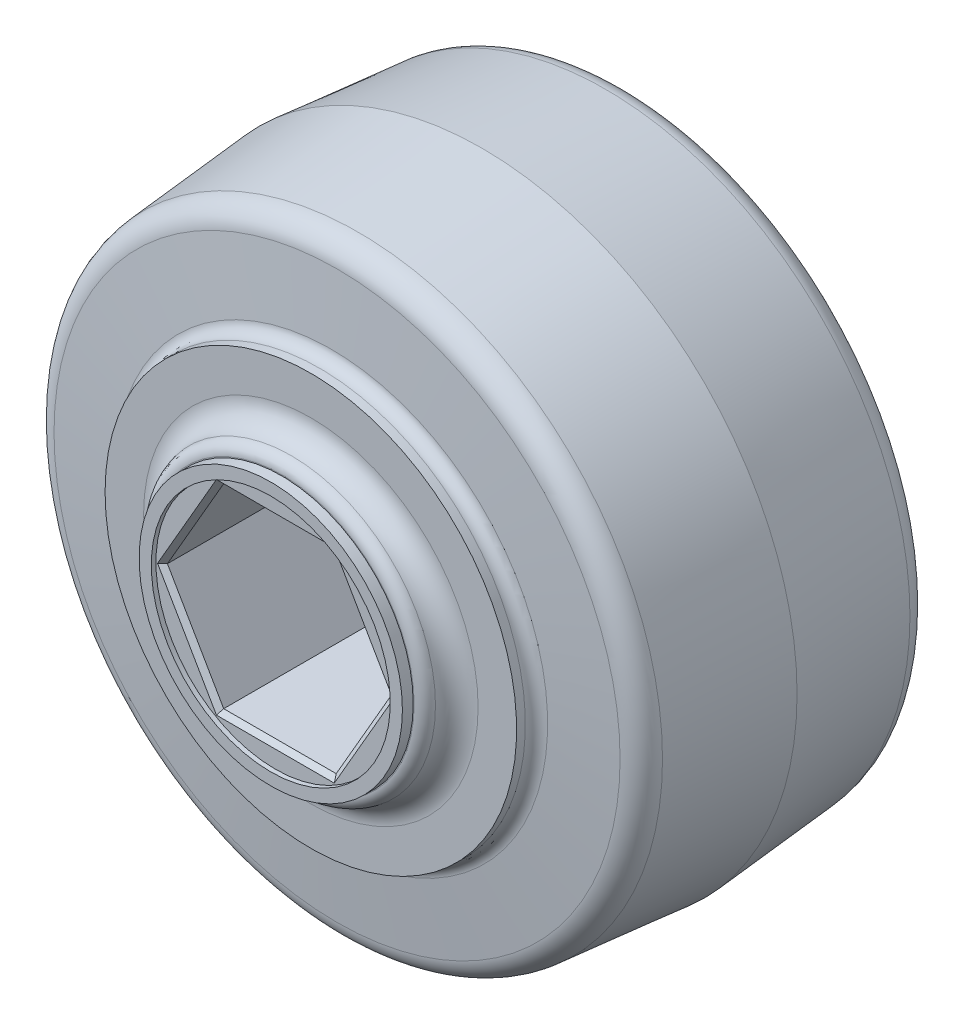
ISO-10303-21;
HEADER;
FILE_DESCRIPTION(('STEP AP214'),'2;1');
FILE_NAME('part.step','',(''),(''),'','','');
FILE_SCHEMA(('AUTOMOTIVE_DESIGN { 1 0 10303 214 1 1 1 1 }'));
ENDSEC;
DATA;
#1=APPLICATION_CONTEXT('core data for automotive mechanical design processes');
#2=APPLICATION_PROTOCOL_DEFINITION('international standard','automotive_design',2000,#1);
#3=PRODUCT_CONTEXT('',#1,'mechanical');
#4=PRODUCT('Part','Part','',(#3));
#5=PRODUCT_RELATED_PRODUCT_CATEGORY('part','',(#4));
#6=PRODUCT_DEFINITION_FORMATION('','',#4);
#7=PRODUCT_DEFINITION_CONTEXT('part definition',#1,'design');
#8=PRODUCT_DEFINITION('design','',#6,#7);
#9=PRODUCT_DEFINITION_SHAPE('','',#8);
#10=(LENGTH_UNIT() NAMED_UNIT(*) SI_UNIT(.MILLI.,.METRE.));
#11=(NAMED_UNIT(*) PLANE_ANGLE_UNIT() SI_UNIT($,.RADIAN.));
#12=(NAMED_UNIT(*) SI_UNIT($,.STERADIAN.) SOLID_ANGLE_UNIT());
#13=UNCERTAINTY_MEASURE_WITH_UNIT(LENGTH_MEASURE(1.E-05),#10,'distance_accuracy_value','');
#14=(GEOMETRIC_REPRESENTATION_CONTEXT(3) GLOBAL_UNCERTAINTY_ASSIGNED_CONTEXT((#13)) GLOBAL_UNIT_ASSIGNED_CONTEXT((#10,
#11,#12)) REPRESENTATION_CONTEXT('',''));
#15=CARTESIAN_POINT('',(0.,0.,0.));
#16=DIRECTION('',(0.,0.,1.));
#17=DIRECTION('',(1.,0.,0.));
#18=AXIS2_PLACEMENT_3D('',#15,#16,#17);
#19=CARTESIAN_POINT('',(0.,0.,-13.0937));
#20=DIRECTION('',(0.,0.,-1.));
#21=DIRECTION('',(-1.,0.,0.));
#22=AXIS2_PLACEMENT_3D('',#19,#20,#21);
#23=PLANE('',#22);
#24=CARTESIAN_POINT('',(0.,0.,-13.0937));
#25=DIRECTION('',(0.,0.,-1.));
#26=DIRECTION('',(-1.,0.,0.));
#27=AXIS2_PLACEMENT_3D('',#24,#25,#26);
#28=CIRCLE('',#27,8.66586367654745);
#29=CARTESIAN_POINT('',(-8.66586367654745,0.,-13.0937));
#30=VERTEX_POINT('',#29);
#31=EDGE_CURVE('E208',#30,#30,#28,.T.);
#32=ORIENTED_EDGE('',*,*,#31,.T.);
#33=EDGE_LOOP('',(#32));
#34=FACE_BOUND('',#33,.T.);
#35=CARTESIAN_POINT('',(0.,0.,-13.0937));
#36=DIRECTION('',(0.,0.,-1.));
#37=DIRECTION('',(-1.,0.,0.));
#38=AXIS2_PLACEMENT_3D('',#35,#36,#37);
#39=CIRCLE('',#38,8.60349118345969);
#40=CARTESIAN_POINT('',(-8.60349118345969,0.,-13.0937));
#41=VERTEX_POINT('',#40);
#42=EDGE_CURVE('E420',#41,#41,#39,.T.);
#43=ORIENTED_EDGE('',*,*,#42,.F.);
#44=EDGE_LOOP('',(#43));
#45=FACE_BOUND('',#44,.T.);
#46=ADVANCED_FACE('F34',(#34,#45),#23,.T.);
#47=CARTESIAN_POINT('',(9.44973089756054,0.,13.0937));
#48=DIRECTION('',(0.,0.,1.));
#49=DIRECTION('',(1.,0.,0.));
#50=AXIS2_PLACEMENT_3D('',#47,#48,#49);
#51=PLANE('',#50);
#52=CARTESIAN_POINT('',(0.,0.,13.0937));
#53=DIRECTION('',(0.,0.,1.));
#54=DIRECTION('',(1.,0.,0.));
#55=AXIS2_PLACEMENT_3D('',#52,#53,#54);
#56=CIRCLE('',#55,8.66586367654745);
#57=CARTESIAN_POINT('',(8.66586367654745,0.,13.0937));
#58=VERTEX_POINT('',#57);
#59=EDGE_CURVE('E244',#58,#58,#56,.T.);
#60=ORIENTED_EDGE('',*,*,#59,.T.);
#61=EDGE_LOOP('',(#60));
#62=FACE_BOUND('',#61,.T.);
#63=CARTESIAN_POINT('',(0.,0.,13.0937));
#64=DIRECTION('',(0.,0.,1.));
#65=DIRECTION('',(1.,0.,0.));
#66=AXIS2_PLACEMENT_3D('',#63,#64,#65);
#67=CIRCLE('',#66,8.60349118345969);
#68=CARTESIAN_POINT('',(8.60349118345969,0.,13.0937));
#69=VERTEX_POINT('',#68);
#70=EDGE_CURVE('E414',#69,#69,#67,.T.);
#71=ORIENTED_EDGE('',*,*,#70,.F.);
#72=EDGE_LOOP('',(#71));
#73=FACE_BOUND('',#72,.T.);
#74=ADVANCED_FACE('F280',(#62,#73),#51,.T.);
#75=CARTESIAN_POINT('',(0.,0.,12.6999999999973));
#76=DIRECTION('',(0.,0.,-1.));
#77=DIRECTION('',(-1.,0.,0.));
#78=AXIS2_PLACEMENT_3D('',#75,#76,#77);
#79=TOROIDAL_SURFACE('',#78,10.922,1.524);
#80=CARTESIAN_POINT('',(0.,0.,12.4544666666658));
#81=DIRECTION('',(0.,0.,1.));
#82=DIRECTION('',(1.,0.,0.));
#83=AXIS2_PLACEMENT_3D('',#80,#81,#82);
#84=CIRCLE('',#83,9.41790911769829);
#85=CARTESIAN_POINT('',(9.41790911769829,0.,12.4544666666658));
#86=VERTEX_POINT('',#85);
#87=EDGE_CURVE('E241',#86,#86,#84,.F.);
#88=ORIENTED_EDGE('',*,*,#87,.T.);
#89=EDGE_LOOP('',(#88));
#90=FACE_BOUND('',#89,.T.);
#91=CARTESIAN_POINT('',(0.,0.,11.1759999999973));
#92=DIRECTION('',(0.,0.,-1.));
#93=DIRECTION('',(-1.,0.,0.));
#94=AXIS2_PLACEMENT_3D('',#91,#92,#93);
#95=CIRCLE('',#94,10.922);
#96=CARTESIAN_POINT('',(-10.922,0.,11.1759999999973));
#97=VERTEX_POINT('',#96);
#98=EDGE_CURVE('E168',#97,#97,#95,.T.);
#99=ORIENTED_EDGE('',*,*,#98,.F.);
#100=EDGE_LOOP('',(#99));
#101=FACE_BOUND('',#100,.T.);
#102=ADVANCED_FACE('F286',(#90,#101),#79,.F.);
#103=CARTESIAN_POINT('',(13.4366,0.,11.1759999999973));
#104=DIRECTION('',(0.,0.,1.));
#105=DIRECTION('',(1.,0.,0.));
#106=AXIS2_PLACEMENT_3D('',#103,#104,#105);
#107=PLANE('',#106);
#108=ORIENTED_EDGE('',*,*,#98,.T.);
#109=EDGE_LOOP('',(#108));
#110=FACE_BOUND('',#109,.T.);
#111=CARTESIAN_POINT('',(0.,0.,11.1759999999973));
#112=DIRECTION('',(0.,0.,-1.));
#113=DIRECTION('',(-1.,0.,0.));
#114=AXIS2_PLACEMENT_3D('',#111,#112,#113);
#115=CIRCLE('',#114,13.4366);
#116=CARTESIAN_POINT('',(-13.4366,0.,11.1759999999973));
#117=VERTEX_POINT('',#116);
#118=EDGE_CURVE('E397',#117,#117,#115,.T.);
#119=ORIENTED_EDGE('',*,*,#118,.F.);
#120=EDGE_LOOP('',(#119));
#121=FACE_BOUND('',#120,.T.);
#122=ADVANCED_FACE('F322',(#110,#121),#107,.T.);
#123=CARTESIAN_POINT('',(0.,0.,13.0937));
#124=DIRECTION('',(0.,0.,-1.));
#125=DIRECTION('',(-1.,0.,0.));
#126=AXIS2_PLACEMENT_3D('',#123,#124,#125);
#127=CYLINDRICAL_SURFACE('',#126,13.4366);
#128=CARTESIAN_POINT('',(0.,0.,10.6042443545986));
#129=DIRECTION('',(0.,0.,-1.));
#130=DIRECTION('',(-1.,0.,0.));
#131=AXIS2_PLACEMENT_3D('',#128,#129,#130);
#132=CIRCLE('',#131,13.4366);
#133=CARTESIAN_POINT('',(-13.4366,0.,10.6042443545986));
#134=VERTEX_POINT('',#133);
#135=EDGE_CURVE('E256',#134,#134,#132,.F.);
#136=ORIENTED_EDGE('',*,*,#135,.T.);
#137=EDGE_LOOP('',(#136));
#138=FACE_BOUND('',#137,.T.);
#139=ORIENTED_EDGE('',*,*,#118,.T.);
#140=EDGE_LOOP('',(#139));
#141=FACE_BOUND('',#140,.T.);
#142=ADVANCED_FACE('F318',(#138,#141),#127,.T.);
#143=CARTESIAN_POINT('',(0.,0.,9.35314991261315));
#144=DIRECTION('',(0.,0.,-1.));
#145=DIRECTION('',(-1.,0.,0.));
#146=AXIS2_PLACEMENT_3D('',#143,#144,#145);
#147=CONICAL_SURFACE('',#146,19.7557054143877,1.48352986419519);
#148=CARTESIAN_POINT('',(0.,0.,9.46460361644323));
#149=DIRECTION('',(0.,0.,1.));
#150=DIRECTION('',(1.,0.,0.));
#151=AXIS2_PLACEMENT_3D('',#148,#149,#150);
#152=CIRCLE('',#151,18.4817837502734);
#153=CARTESIAN_POINT('',(18.4817837502734,0.,9.46460361644323));
#154=VERTEX_POINT('',#153);
#155=EDGE_CURVE('E11',#154,#154,#152,.T.);
#156=ORIENTED_EDGE('',*,*,#155,.T.);
#157=EDGE_LOOP('',(#156));
#158=FACE_BOUND('',#157,.T.);
#159=CARTESIAN_POINT('',(0.,0.,9.84514399465269));
#160=DIRECTION('',(0.,0.,-1.));
#161=DIRECTION('',(-1.,0.,0.));
#162=AXIS2_PLACEMENT_3D('',#159,#160,#161);
#163=CIRCLE('',#162,14.1321873240263);
#164=CARTESIAN_POINT('',(-14.1321873240263,0.,9.84514399465269));
#165=VERTEX_POINT('',#164);
#166=EDGE_CURVE('E253',#165,#165,#163,.T.);
#167=ORIENTED_EDGE('',*,*,#166,.T.);
#168=EDGE_LOOP('',(#167));
#169=FACE_BOUND('',#168,.T.);
#170=ADVANCED_FACE('F315',(#158,#169),#147,.T.);
#171=CARTESIAN_POINT('',(0.,0.,-2.692290834716E-12));
#172=DIRECTION('',(0.,0.,-1.));
#173=DIRECTION('',(-1.,0.,0.));
#174=AXIS2_PLACEMENT_3D('',#171,#172,#173);
#175=CONICAL_SURFACE('',#174,20.574,0.0872664625997093);
#176=CARTESIAN_POINT('',(0.,0.,8.07922824849883));
#177=DIRECTION('',(0.,0.,1.));
#178=DIRECTION('',(1.,0.,0.));
#179=AXIS2_PLACEMENT_3D('',#176,#177,#178);
#180=CIRCLE('',#179,19.8671591182178);
#181=CARTESIAN_POINT('',(19.8671591182178,0.,8.07922824849883));
#182=VERTEX_POINT('',#181);
#183=EDGE_CURVE('E42',#182,#182,#180,.F.);
#184=ORIENTED_EDGE('',*,*,#183,.T.);
#185=EDGE_LOOP('',(#184));
#186=FACE_BOUND('',#185,.T.);
#187=CARTESIAN_POINT('',(0.,0.,-2.692290834716E-12));
#188=DIRECTION('',(0.,0.,-1.));
#189=DIRECTION('',(-1.,0.,0.));
#190=AXIS2_PLACEMENT_3D('',#187,#188,#189);
#191=CIRCLE('',#190,20.574);
#192=CARTESIAN_POINT('',(-20.574,0.,-2.692290834716E-12));
#193=VERTEX_POINT('',#192);
#194=EDGE_CURVE('E399',#193,#193,#191,.T.);
#195=ORIENTED_EDGE('',*,*,#194,.F.);
#196=EDGE_LOOP('',(#195));
#197=FACE_BOUND('',#196,.T.);
#198=ADVANCED_FACE('F267',(#186,#197),#175,.T.);
#199=CARTESIAN_POINT('',(0.,0.,-9.35314991261852));
#200=DIRECTION('',(0.,0.,1.));
#201=DIRECTION('',(1.,0.,0.));
#202=AXIS2_PLACEMENT_3D('',#199,#200,#201);
#203=CONICAL_SURFACE('',#202,19.7557054143877,0.0872664625997088);
#204=CARTESIAN_POINT('',(0.,0.,-8.07922824850418));
#205=DIRECTION('',(0.,0.,-1.));
#206=DIRECTION('',(-1.,0.,0.));
#207=AXIS2_PLACEMENT_3D('',#204,#205,#206);
#208=CIRCLE('',#207,19.8671591182178);
#209=CARTESIAN_POINT('',(-19.8671591182178,0.,-8.07922824850418));
#210=VERTEX_POINT('',#209);
#211=EDGE_CURVE('E262',#210,#210,#208,.F.);
#212=ORIENTED_EDGE('',*,*,#211,.T.);
#213=EDGE_LOOP('',(#212));
#214=FACE_BOUND('',#213,.T.);
#215=ORIENTED_EDGE('',*,*,#194,.T.);
#216=EDGE_LOOP('',(#215));
#217=FACE_BOUND('',#216,.T.);
#218=ADVANCED_FACE('F308',(#214,#217),#203,.T.);
#219=CARTESIAN_POINT('',(0.,0.,-9.90600000000268));
#220=DIRECTION('',(0.,0.,1.));
#221=DIRECTION('',(1.,0.,0.));
#222=AXIS2_PLACEMENT_3D('',#219,#220,#221);
#223=CONICAL_SURFACE('',#222,13.4366,1.48352986419519);
#224=CARTESIAN_POINT('',(0.,0.,-9.46460361644859));
#225=DIRECTION('',(0.,0.,-1.));
#226=DIRECTION('',(-1.,0.,0.));
#227=AXIS2_PLACEMENT_3D('',#224,#225,#226);
#228=CIRCLE('',#227,18.4817837502734);
#229=CARTESIAN_POINT('',(-18.4817837502734,0.,-9.46460361644859));
#230=VERTEX_POINT('',#229);
#231=EDGE_CURVE('E259',#230,#230,#228,.T.);
#232=ORIENTED_EDGE('',*,*,#231,.T.);
#233=EDGE_LOOP('',(#232));
#234=FACE_BOUND('',#233,.T.);
#235=CARTESIAN_POINT('',(0.,0.,-9.84514399465805));
#236=DIRECTION('',(0.,0.,1.));
#237=DIRECTION('',(1.,0.,0.));
#238=AXIS2_PLACEMENT_3D('',#235,#236,#237);
#239=CIRCLE('',#238,14.1321873240263);
#240=CARTESIAN_POINT('',(14.1321873240263,0.,-9.84514399465805));
#241=VERTEX_POINT('',#240);
#242=EDGE_CURVE('E250',#241,#241,#239,.T.);
#243=ORIENTED_EDGE('',*,*,#242,.T.);
#244=EDGE_LOOP('',(#243));
#245=FACE_BOUND('',#244,.T.);
#246=ADVANCED_FACE('F304',(#234,#245),#223,.T.);
#247=CARTESIAN_POINT('',(0.,0.,13.0937));
#248=DIRECTION('',(0.,0.,-1.));
#249=DIRECTION('',(-1.,0.,0.));
#250=AXIS2_PLACEMENT_3D('',#247,#248,#249);
#251=CYLINDRICAL_SURFACE('',#250,13.4366);
#252=CARTESIAN_POINT('',(0.,0.,-10.604244354604));
#253=DIRECTION('',(0.,0.,-1.));
#254=DIRECTION('',(-1.,0.,0.));
#255=AXIS2_PLACEMENT_3D('',#252,#253,#254);
#256=CIRCLE('',#255,13.4366);
#257=CARTESIAN_POINT('',(-13.4366,0.,-10.604244354604));
#258=VERTEX_POINT('',#257);
#259=EDGE_CURVE('E247',#258,#258,#256,.T.);
#260=ORIENTED_EDGE('',*,*,#259,.T.);
#261=EDGE_LOOP('',(#260));
#262=FACE_BOUND('',#261,.T.);
#263=CARTESIAN_POINT('',(0.,0.,-11.1759999999973));
#264=DIRECTION('',(0.,0.,-1.));
#265=DIRECTION('',(-1.,0.,0.));
#266=AXIS2_PLACEMENT_3D('',#263,#264,#265);
#267=CIRCLE('',#266,13.4366);
#268=CARTESIAN_POINT('',(-13.4366,0.,-11.1759999999973));
#269=VERTEX_POINT('',#268);
#270=EDGE_CURVE('E403',#269,#269,#267,.T.);
#271=ORIENTED_EDGE('',*,*,#270,.F.);
#272=EDGE_LOOP('',(#271));
#273=FACE_BOUND('',#272,.T.);
#274=ADVANCED_FACE('F300',(#262,#273),#251,.T.);
#275=CARTESIAN_POINT('',(10.922,0.,-11.1759999999973));
#276=DIRECTION('',(0.,0.,-1.));
#277=DIRECTION('',(-1.,0.,0.));
#278=AXIS2_PLACEMENT_3D('',#275,#276,#277);
#279=PLANE('',#278);
#280=ORIENTED_EDGE('',*,*,#270,.T.);
#281=EDGE_LOOP('',(#280));
#282=FACE_BOUND('',#281,.T.);
#283=CARTESIAN_POINT('',(0.,0.,-11.1759999999973));
#284=DIRECTION('',(0.,0.,-1.));
#285=DIRECTION('',(-1.,0.,0.));
#286=AXIS2_PLACEMENT_3D('',#283,#284,#285);
#287=CIRCLE('',#286,10.922);
#288=CARTESIAN_POINT('',(-10.922,0.,-11.1759999999973));
#289=VERTEX_POINT('',#288);
#290=EDGE_CURVE('E408',#289,#289,#287,.T.);
#291=ORIENTED_EDGE('',*,*,#290,.F.);
#292=EDGE_LOOP('',(#291));
#293=FACE_BOUND('',#292,.T.);
#294=ADVANCED_FACE('F296',(#282,#293),#279,.T.);
#295=CARTESIAN_POINT('',(0.,0.,-12.6999999999973));
#296=DIRECTION('',(0.,0.,-1.));
#297=DIRECTION('',(-1.,0.,0.));
#298=AXIS2_PLACEMENT_3D('',#295,#296,#297);
#299=TOROIDAL_SURFACE('',#298,10.922,1.524);
#300=CARTESIAN_POINT('',(0.,0.,-12.4544666666658));
#301=DIRECTION('',(0.,0.,-1.));
#302=DIRECTION('',(-1.,0.,0.));
#303=AXIS2_PLACEMENT_3D('',#300,#301,#302);
#304=CIRCLE('',#303,9.4179091176983);
#305=CARTESIAN_POINT('',(-9.4179091176983,0.,-12.4544666666658));
#306=VERTEX_POINT('',#305);
#307=EDGE_CURVE('E238',#306,#306,#304,.F.);
#308=ORIENTED_EDGE('',*,*,#307,.T.);
#309=EDGE_LOOP('',(#308));
#310=FACE_BOUND('',#309,.T.);
#311=ORIENTED_EDGE('',*,*,#290,.T.);
#312=EDGE_LOOP('',(#311));
#313=FACE_BOUND('',#312,.T.);
#314=ADVANCED_FACE('F292',(#310,#313),#299,.F.);
#315=CARTESIAN_POINT('',(0.,0.,13.0937));
#316=DIRECTION('',(0.,0.,-1.));
#317=DIRECTION('',(1.,0.,0.));
#318=AXIS2_PLACEMENT_3D('',#315,#316,#317);
#319=CONICAL_SURFACE('',#318,8.60349118345969,0.00872664625996866);
#320=CARTESIAN_POINT('',(0.,0.,13.79375));
#321=DIRECTION('',(0.,0.,1.));
#322=DIRECTION('',(1.,0.,0.));
#323=AXIS2_PLACEMENT_3D('',#320,#321,#322);
#324=CIRCLE('',#323,8.59738193966278);
#325=CARTESIAN_POINT('',(8.59738193966278,0.,13.79375));
#326=VERTEX_POINT('',#325);
#327=EDGE_CURVE('E411',#326,#326,#324,.T.);
#328=ORIENTED_EDGE('',*,*,#327,.F.);
#329=EDGE_LOOP('',(#328));
#330=FACE_BOUND('',#329,.T.);
#331=ORIENTED_EDGE('',*,*,#70,.T.);
#332=EDGE_LOOP('',(#331));
#333=FACE_BOUND('',#332,.T.);
#334=ADVANCED_FACE('F295',(#330,#333),#319,.T.);
#335=CARTESIAN_POINT('',(0.,0.,13.79375));
#336=DIRECTION('',(0.,0.,1.));
#337=DIRECTION('',(1.,0.,0.));
#338=AXIS2_PLACEMENT_3D('',#335,#336,#337);
#339=PLANE('',#338);
#340=CARTESIAN_POINT('',(0.,0.,13.7937499999999));
#341=DIRECTION('',(0.,0.,1.));
#342=DIRECTION('',(0.,-1.,0.));
#343=AXIS2_PLACEMENT_3D('',#340,#341,#342);
#344=CIRCLE('',#343,7.80261806033723);
#345=CARTESIAN_POINT('',(0.,-7.80261806033723,13.7937499999999));
#346=VERTEX_POINT('',#345);
#347=EDGE_CURVE('E440',#346,#346,#344,.T.);
#348=ORIENTED_EDGE('',*,*,#347,.F.);
#349=EDGE_LOOP('',(#348));
#350=FACE_BOUND('',#349,.T.);
#351=ORIENTED_EDGE('',*,*,#327,.T.);
#352=EDGE_LOOP('',(#351));
#353=FACE_BOUND('',#352,.T.);
#354=ADVANCED_FACE('F453',(#350,#353),#339,.T.);
#355=CARTESIAN_POINT('',(0.,0.,-13.0937));
#356=DIRECTION('',(0.,0.,1.));
#357=DIRECTION('',(-1.,0.,0.));
#358=AXIS2_PLACEMENT_3D('',#355,#356,#357);
#359=CONICAL_SURFACE('',#358,8.60349118345969,0.00872664625996866);
#360=CARTESIAN_POINT('',(0.,0.,-13.79375));
#361=DIRECTION('',(0.,0.,-1.));
#362=DIRECTION('',(-1.,0.,0.));
#363=AXIS2_PLACEMENT_3D('',#360,#361,#362);
#364=CIRCLE('',#363,8.59738193966278);
#365=CARTESIAN_POINT('',(-8.59738193966278,0.,-13.79375));
#366=VERTEX_POINT('',#365);
#367=EDGE_CURVE('E417',#366,#366,#364,.T.);
#368=ORIENTED_EDGE('',*,*,#367,.F.);
#369=EDGE_LOOP('',(#368));
#370=FACE_BOUND('',#369,.T.);
#371=ORIENTED_EDGE('',*,*,#42,.T.);
#372=EDGE_LOOP('',(#371));
#373=FACE_BOUND('',#372,.T.);
#374=ADVANCED_FACE('F456',(#370,#373),#359,.T.);
#375=CARTESIAN_POINT('',(0.,0.,-13.79375));
#376=DIRECTION('',(0.,0.,-1.));
#377=DIRECTION('',(-1.,0.,0.));
#378=AXIS2_PLACEMENT_3D('',#375,#376,#377);
#379=PLANE('',#378);
#380=CARTESIAN_POINT('',(0.,0.,-13.7937499999999));
#381=DIRECTION('',(0.,0.,-1.));
#382=DIRECTION('',(0.,1.,0.));
#383=AXIS2_PLACEMENT_3D('',#380,#381,#382);
#384=CIRCLE('',#383,7.80261806033723);
#385=CARTESIAN_POINT('',(0.,7.80261806033723,-13.7937499999999));
#386=VERTEX_POINT('',#385);
#387=EDGE_CURVE('E427',#386,#386,#384,.T.);
#388=ORIENTED_EDGE('',*,*,#387,.F.);
#389=EDGE_LOOP('',(#388));
#390=FACE_BOUND('',#389,.T.);
#391=ORIENTED_EDGE('',*,*,#367,.T.);
#392=EDGE_LOOP('',(#391));
#393=FACE_BOUND('',#392,.T.);
#394=ADVANCED_FACE('F469',(#390,#393),#379,.T.);
#395=CARTESIAN_POINT('',(-3.67350655777283,-6.3627,13.79375));
#396=DIRECTION('',(-0.866025403784439,-0.5,0.));
#397=DIRECTION('',(0.5,-0.866025403784439,0.));
#398=AXIS2_PLACEMENT_3D('',#395,#396,#397);
#399=PLANE('',#398);
#400=DIRECTION('',(0.,0.,-1.));
#401=VECTOR('',#400,1.);
#402=CARTESIAN_POINT('',(-7.34701311554566,0.,13.79375));
#403=LINE('',#402,#401);
#404=CARTESIAN_POINT('',(-7.34701311554566,0.,13.19375));
#405=VERTEX_POINT('',#404);
#406=CARTESIAN_POINT('',(-7.34701311554566,0.,-13.19375));
#407=VERTEX_POINT('',#406);
#408=EDGE_CURVE('E423',#405,#407,#403,.T.);
#409=ORIENTED_EDGE('',*,*,#408,.F.);
#410=DIRECTION('',(0.5,-0.866025403784439,0.));
#411=VECTOR('',#410,1.);
#412=CARTESIAN_POINT('',(-3.67350655777283,-6.3627,13.19375));
#413=LINE('',#412,#411);
#414=CARTESIAN_POINT('',(-3.67350655777283,-6.3627,13.19375));
#415=VERTEX_POINT('',#414);
#416=EDGE_CURVE('E187',#405,#415,#413,.T.);
#417=ORIENTED_EDGE('',*,*,#416,.T.);
#418=DIRECTION('',(0.,0.,-1.));
#419=VECTOR('',#418,1.);
#420=CARTESIAN_POINT('',(-3.67350655777283,-6.3627,13.79375));
#421=LINE('',#420,#419);
#422=CARTESIAN_POINT('',(-3.67350655777283,-6.3627,-13.19375));
#423=VERTEX_POINT('',#422);
#424=EDGE_CURVE('E132',#415,#423,#421,.T.);
#425=ORIENTED_EDGE('',*,*,#424,.T.);
#426=DIRECTION('',(-0.5,0.866025403784439,0.));
#427=VECTOR('',#426,1.);
#428=CARTESIAN_POINT('',(-3.67350655777283,-6.3627,-13.19375));
#429=LINE('',#428,#427);
#430=EDGE_CURVE('E185',#423,#407,#429,.T.);
#431=ORIENTED_EDGE('',*,*,#430,.T.);
#432=EDGE_LOOP('',(#409,#417,#425,#431));
#433=FACE_BOUND('',#432,.T.);
#434=ADVANCED_FACE('F473',(#433),#399,.F.);
#435=CARTESIAN_POINT('',(3.67350655777283,-6.3627,13.79375));
#436=DIRECTION('',(0.,-1.,0.));
#437=DIRECTION('',(1.,0.,0.));
#438=AXIS2_PLACEMENT_3D('',#435,#436,#437);
#439=PLANE('',#438);
#440=ORIENTED_EDGE('',*,*,#424,.F.);
#441=DIRECTION('',(1.,0.,0.));
#442=VECTOR('',#441,1.);
#443=CARTESIAN_POINT('',(3.67350655777283,-6.3627,13.19375));
#444=LINE('',#443,#442);
#445=CARTESIAN_POINT('',(3.67350655777283,-6.3627,13.19375));
#446=VERTEX_POINT('',#445);
#447=EDGE_CURVE('E126',#415,#446,#444,.T.);
#448=ORIENTED_EDGE('',*,*,#447,.T.);
#449=DIRECTION('',(0.,0.,-1.));
#450=VECTOR('',#449,1.);
#451=CARTESIAN_POINT('',(3.67350655777283,-6.3627,13.79375));
#452=LINE('',#451,#450);
#453=CARTESIAN_POINT('',(3.67350655777283,-6.3627,-13.19375));
#454=VERTEX_POINT('',#453);
#455=EDGE_CURVE('E129',#446,#454,#452,.T.);
#456=ORIENTED_EDGE('',*,*,#455,.T.);
#457=DIRECTION('',(-1.,0.,0.));
#458=VECTOR('',#457,1.);
#459=CARTESIAN_POINT('',(3.67350655777283,-6.3627,-13.19375));
#460=LINE('',#459,#458);
#461=EDGE_CURVE('E138',#454,#423,#460,.T.);
#462=ORIENTED_EDGE('',*,*,#461,.T.);
#463=EDGE_LOOP('',(#440,#448,#456,#462));
#464=FACE_BOUND('',#463,.T.);
#465=ADVANCED_FACE('F128',(#464),#439,.F.);
#466=CARTESIAN_POINT('',(7.34701311554566,0.,13.79375));
#467=DIRECTION('',(0.866025403784439,-0.5,0.));
#468=DIRECTION('',(0.5,0.866025403784439,0.));
#469=AXIS2_PLACEMENT_3D('',#466,#467,#468);
#470=PLANE('',#469);
#471=ORIENTED_EDGE('',*,*,#455,.F.);
#472=DIRECTION('',(0.5,0.866025403784439,0.));
#473=VECTOR('',#472,1.);
#474=CARTESIAN_POINT('',(7.34701311554566,0.,13.19375));
#475=LINE('',#474,#473);
#476=CARTESIAN_POINT('',(7.34701311554566,0.,13.19375));
#477=VERTEX_POINT('',#476);
#478=EDGE_CURVE('E145',#446,#477,#475,.T.);
#479=ORIENTED_EDGE('',*,*,#478,.T.);
#480=DIRECTION('',(0.,0.,-1.));
#481=VECTOR('',#480,1.);
#482=CARTESIAN_POINT('',(7.34701311554566,0.,13.79375));
#483=LINE('',#482,#481);
#484=CARTESIAN_POINT('',(7.34701311554566,0.,-13.19375));
#485=VERTEX_POINT('',#484);
#486=EDGE_CURVE('E149',#477,#485,#483,.T.);
#487=ORIENTED_EDGE('',*,*,#486,.T.);
#488=DIRECTION('',(-0.5,-0.866025403784439,0.));
#489=VECTOR('',#488,1.);
#490=CARTESIAN_POINT('',(7.34701311554566,0.,-13.19375));
#491=LINE('',#490,#489);
#492=EDGE_CURVE('E148',#485,#454,#491,.T.);
#493=ORIENTED_EDGE('',*,*,#492,.T.);
#494=EDGE_LOOP('',(#471,#479,#487,#493));
#495=FACE_BOUND('',#494,.T.);
#496=ADVANCED_FACE('F142',(#495),#470,.F.);
#497=CARTESIAN_POINT('',(3.67350655777283,6.3627,13.79375));
#498=DIRECTION('',(0.866025403784439,0.5,0.));
#499=DIRECTION('',(-0.5,0.866025403784439,0.));
#500=AXIS2_PLACEMENT_3D('',#497,#498,#499);
#501=PLANE('',#500);
#502=ORIENTED_EDGE('',*,*,#486,.F.);
#503=DIRECTION('',(-0.5,0.866025403784439,0.));
#504=VECTOR('',#503,1.);
#505=CARTESIAN_POINT('',(3.67350655777283,6.3627,13.19375));
#506=LINE('',#505,#504);
#507=CARTESIAN_POINT('',(3.67350655777283,6.3627,13.19375));
#508=VERTEX_POINT('',#507);
#509=EDGE_CURVE('E183',#477,#508,#506,.T.);
#510=ORIENTED_EDGE('',*,*,#509,.T.);
#511=DIRECTION('',(0.,0.,-1.));
#512=VECTOR('',#511,1.);
#513=CARTESIAN_POINT('',(3.67350655777283,6.3627,13.79375));
#514=LINE('',#513,#512);
#515=CARTESIAN_POINT('',(3.67350655777283,6.3627,-13.19375));
#516=VERTEX_POINT('',#515);
#517=EDGE_CURVE('E430',#508,#516,#514,.T.);
#518=ORIENTED_EDGE('',*,*,#517,.T.);
#519=DIRECTION('',(0.5,-0.866025403784439,0.));
#520=VECTOR('',#519,1.);
#521=CARTESIAN_POINT('',(3.67350655777283,6.3627,-13.19375));
#522=LINE('',#521,#520);
#523=EDGE_CURVE('E137',#516,#485,#522,.T.);
#524=ORIENTED_EDGE('',*,*,#523,.T.);
#525=EDGE_LOOP('',(#502,#510,#518,#524));
#526=FACE_BOUND('',#525,.T.);
#527=ADVANCED_FACE('F486',(#526),#501,.F.);
#528=CARTESIAN_POINT('',(-3.67350655777283,6.3627,13.79375));
#529=DIRECTION('',(0.,1.,0.));
#530=DIRECTION('',(-1.,0.,0.));
#531=AXIS2_PLACEMENT_3D('',#528,#529,#530);
#532=PLANE('',#531);
#533=ORIENTED_EDGE('',*,*,#517,.F.);
#534=DIRECTION('',(-1.,0.,0.));
#535=VECTOR('',#534,1.);
#536=CARTESIAN_POINT('',(-3.67350655777283,6.3627,13.19375));
#537=LINE('',#536,#535);
#538=CARTESIAN_POINT('',(-3.67350655777283,6.3627,13.19375));
#539=VERTEX_POINT('',#538);
#540=EDGE_CURVE('E191',#508,#539,#537,.T.);
#541=ORIENTED_EDGE('',*,*,#540,.T.);
#542=DIRECTION('',(0.,0.,-1.));
#543=VECTOR('',#542,1.);
#544=CARTESIAN_POINT('',(-3.67350655777283,6.3627,13.79375));
#545=LINE('',#544,#543);
#546=CARTESIAN_POINT('',(-3.67350655777283,6.3627,-13.19375));
#547=VERTEX_POINT('',#546);
#548=EDGE_CURVE('E426',#539,#547,#545,.T.);
#549=ORIENTED_EDGE('',*,*,#548,.T.);
#550=DIRECTION('',(1.,0.,0.));
#551=VECTOR('',#550,1.);
#552=CARTESIAN_POINT('',(-3.67350655777283,6.3627,-13.19375));
#553=LINE('',#552,#551);
#554=EDGE_CURVE('E189',#547,#516,#553,.T.);
#555=ORIENTED_EDGE('',*,*,#554,.T.);
#556=EDGE_LOOP('',(#533,#541,#549,#555));
#557=FACE_BOUND('',#556,.T.);
#558=ADVANCED_FACE('F482',(#557),#532,.F.);
#559=CARTESIAN_POINT('',(-7.34701311554566,0.,13.79375));
#560=DIRECTION('',(-0.866025403784439,0.5,0.));
#561=DIRECTION('',(-0.5,-0.866025403784439,0.));
#562=AXIS2_PLACEMENT_3D('',#559,#560,#561);
#563=PLANE('',#562);
#564=ORIENTED_EDGE('',*,*,#548,.F.);
#565=DIRECTION('',(-0.5,-0.866025403784439,0.));
#566=VECTOR('',#565,1.);
#567=CARTESIAN_POINT('',(-7.34701311554566,0.,13.19375));
#568=LINE('',#567,#566);
#569=EDGE_CURVE('E195',#539,#405,#568,.T.);
#570=ORIENTED_EDGE('',*,*,#569,.T.);
#571=ORIENTED_EDGE('',*,*,#408,.T.);
#572=DIRECTION('',(0.5,0.866025403784439,0.));
#573=VECTOR('',#572,1.);
#574=CARTESIAN_POINT('',(-7.34701311554566,0.,-13.19375));
#575=LINE('',#574,#573);
#576=EDGE_CURVE('E193',#407,#547,#575,.T.);
#577=ORIENTED_EDGE('',*,*,#576,.T.);
#578=EDGE_LOOP('',(#564,#570,#571,#577));
#579=FACE_BOUND('',#578,.T.);
#580=ADVANCED_FACE('F478',(#579),#563,.F.);
#581=CARTESIAN_POINT('',(0.,7.8,-13.49375));
#582=DIRECTION('',(0.,0.,1.));
#583=DIRECTION('',(0.,-1.,0.));
#584=AXIS2_PLACEMENT_3D('',#581,#582,#583);
#585=PLANE('',#584);
#586=DIRECTION('',(0.5,0.866025403784439,0.));
#587=VECTOR('',#586,1.);
#588=CARTESIAN_POINT('',(9.14756653255388,2.51865000000001,-13.49375));
#589=LINE('',#588,#587);
#590=CARTESIAN_POINT('',(3.84671163852972,-6.66269999999999,-13.49375));
#591=VERTEX_POINT('',#590);
#592=CARTESIAN_POINT('',(7.69342327705943,0.,-13.49375));
#593=VERTEX_POINT('',#592);
#594=EDGE_CURVE('E57',#591,#593,#589,.T.);
#595=ORIENTED_EDGE('',*,*,#594,.T.);
#596=DIRECTION('',(-0.5,0.866025403784439,0.));
#597=VECTOR('',#596,1.);
#598=CARTESIAN_POINT('',(2.39256838303526,9.18134999999999,-13.49375));
#599=LINE('',#598,#597);
#600=CARTESIAN_POINT('',(3.84671163852971,6.66269999999999,-13.49375));
#601=VERTEX_POINT('',#600);
#602=EDGE_CURVE('E206',#593,#601,#599,.T.);
#603=ORIENTED_EDGE('',*,*,#602,.T.);
#604=DIRECTION('',(-1.,0.,0.));
#605=VECTOR('',#604,1.);
#606=CARTESIAN_POINT('',(0.,6.66269999999999,-13.49375));
#607=LINE('',#606,#605);
#608=CARTESIAN_POINT('',(-3.84671163852971,6.66269999999999,-13.49375));
#609=VERTEX_POINT('',#608);
#610=EDGE_CURVE('E204',#601,#609,#607,.T.);
#611=ORIENTED_EDGE('',*,*,#610,.T.);
#612=DIRECTION('',(-0.5,-0.866025403784439,0.));
#613=VECTOR('',#612,1.);
#614=CARTESIAN_POINT('',(-2.39256838303526,9.18134999999999,-13.49375));
#615=LINE('',#614,#613);
#616=CARTESIAN_POINT('',(-7.69342327705943,0.,-13.49375));
#617=VERTEX_POINT('',#616);
#618=EDGE_CURVE('E201',#609,#617,#615,.T.);
#619=ORIENTED_EDGE('',*,*,#618,.T.);
#620=DIRECTION('',(0.5,-0.866025403784439,0.));
#621=VECTOR('',#620,1.);
#622=CARTESIAN_POINT('',(-9.14756653255388,2.51865,-13.49375));
#623=LINE('',#622,#621);
#624=CARTESIAN_POINT('',(-3.84671163852971,-6.66269999999999,-13.49375));
#625=VERTEX_POINT('',#624);
#626=EDGE_CURVE('E197',#617,#625,#623,.T.);
#627=ORIENTED_EDGE('',*,*,#626,.T.);
#628=DIRECTION('',(1.,0.,0.));
#629=VECTOR('',#628,1.);
#630=CARTESIAN_POINT('',(0.,-6.66269999999999,-13.49375));
#631=LINE('',#630,#629);
#632=EDGE_CURVE('E199',#625,#591,#631,.T.);
#633=ORIENTED_EDGE('',*,*,#632,.T.);
#634=EDGE_LOOP('',(#595,#603,#611,#619,#627,#633));
#635=FACE_BOUND('',#634,.T.);
#636=CARTESIAN_POINT('',(0.,0.,-13.49375));
#637=DIRECTION('',(0.,0.,-1.));
#638=DIRECTION('',(0.,1.,0.));
#639=AXIS2_PLACEMENT_3D('',#636,#637,#638);
#640=CIRCLE('',#639,7.8);
#641=CARTESIAN_POINT('',(0.,7.8,-13.49375));
#642=VERTEX_POINT('',#641);
#643=EDGE_CURVE('E437',#642,#642,#640,.T.);
#644=ORIENTED_EDGE('',*,*,#643,.T.);
#645=EDGE_LOOP('',(#644));
#646=FACE_BOUND('',#645,.T.);
#647=ADVANCED_FACE('F481',(#635,#646),#585,.F.);
#648=CARTESIAN_POINT('',(0.,0.,-13.7937499999999));
#649=DIRECTION('',(0.,0.,-1.));
#650=DIRECTION('',(0.,1.,0.));
#651=AXIS2_PLACEMENT_3D('',#648,#649,#650);
#652=CONICAL_SURFACE('',#651,7.80261806033723,0.00872664625997262);
#653=ORIENTED_EDGE('',*,*,#643,.F.);
#654=EDGE_LOOP('',(#653));
#655=FACE_BOUND('',#654,.T.);
#656=ORIENTED_EDGE('',*,*,#387,.T.);
#657=EDGE_LOOP('',(#656));
#658=FACE_BOUND('',#657,.T.);
#659=ADVANCED_FACE('F495',(#655,#658),#652,.F.);
#660=CARTESIAN_POINT('',(0.,-7.8,13.49375));
#661=DIRECTION('',(0.,0.,-1.));
#662=DIRECTION('',(0.,1.,0.));
#663=AXIS2_PLACEMENT_3D('',#660,#661,#662);
#664=PLANE('',#663);
#665=DIRECTION('',(0.5,-0.866025403784439,0.));
#666=VECTOR('',#665,1.);
#667=CARTESIAN_POINT('',(9.14756653255388,-2.51865,13.49375));
#668=LINE('',#667,#666);
#669=CARTESIAN_POINT('',(3.84671163852971,6.66269999999999,13.49375));
#670=VERTEX_POINT('',#669);
#671=CARTESIAN_POINT('',(7.69342327705943,0.,13.49375));
#672=VERTEX_POINT('',#671);
#673=EDGE_CURVE('E175',#670,#672,#668,.T.);
#674=ORIENTED_EDGE('',*,*,#673,.T.);
#675=DIRECTION('',(-0.5,-0.866025403784439,0.));
#676=VECTOR('',#675,1.);
#677=CARTESIAN_POINT('',(2.39256838303526,-9.18134999999999,13.49375));
#678=LINE('',#677,#676);
#679=CARTESIAN_POINT('',(3.84671163852971,-6.66269999999999,13.49375));
#680=VERTEX_POINT('',#679);
#681=EDGE_CURVE('E178',#672,#680,#678,.T.);
#682=ORIENTED_EDGE('',*,*,#681,.T.);
#683=DIRECTION('',(-1.,0.,0.));
#684=VECTOR('',#683,1.);
#685=CARTESIAN_POINT('',(0.,-6.66269999999999,13.49375));
#686=LINE('',#685,#684);
#687=CARTESIAN_POINT('',(-3.84671163852971,-6.66269999999999,13.49375));
#688=VERTEX_POINT('',#687);
#689=EDGE_CURVE('E154',#680,#688,#686,.T.);
#690=ORIENTED_EDGE('',*,*,#689,.T.);
#691=DIRECTION('',(-0.5,0.866025403784439,0.));
#692=VECTOR('',#691,1.);
#693=CARTESIAN_POINT('',(-2.39256838303526,-9.18134999999999,13.49375));
#694=LINE('',#693,#692);
#695=CARTESIAN_POINT('',(-7.69342327705943,0.,13.49375));
#696=VERTEX_POINT('',#695);
#697=EDGE_CURVE('E173',#688,#696,#694,.T.);
#698=ORIENTED_EDGE('',*,*,#697,.T.);
#699=DIRECTION('',(0.5,0.866025403784439,0.));
#700=VECTOR('',#699,1.);
#701=CARTESIAN_POINT('',(-9.14756653255388,-2.51865000000001,13.49375));
#702=LINE('',#701,#700);
#703=CARTESIAN_POINT('',(-3.84671163852971,6.66269999999999,13.49375));
#704=VERTEX_POINT('',#703);
#705=EDGE_CURVE('E164',#696,#704,#702,.T.);
#706=ORIENTED_EDGE('',*,*,#705,.T.);
#707=DIRECTION('',(1.,0.,0.));
#708=VECTOR('',#707,1.);
#709=CARTESIAN_POINT('',(0.,6.66269999999999,13.49375));
#710=LINE('',#709,#708);
#711=EDGE_CURVE('E166',#704,#670,#710,.T.);
#712=ORIENTED_EDGE('',*,*,#711,.T.);
#713=EDGE_LOOP('',(#674,#682,#690,#698,#706,#712));
#714=FACE_BOUND('',#713,.T.);
#715=CARTESIAN_POINT('',(0.,0.,13.49375));
#716=DIRECTION('',(0.,0.,1.));
#717=DIRECTION('',(0.,-1.,0.));
#718=AXIS2_PLACEMENT_3D('',#715,#716,#717);
#719=CIRCLE('',#718,7.8);
#720=CARTESIAN_POINT('',(0.,-7.8,13.49375));
#721=VERTEX_POINT('',#720);
#722=EDGE_CURVE('E221',#721,#721,#719,.T.);
#723=ORIENTED_EDGE('',*,*,#722,.T.);
#724=EDGE_LOOP('',(#723));
#725=FACE_BOUND('',#724,.T.);
#726=ADVANCED_FACE('F446',(#714,#725),#664,.F.);
#727=CARTESIAN_POINT('',(0.,0.,13.7937499999999));
#728=DIRECTION('',(0.,0.,1.));
#729=DIRECTION('',(0.,-1.,0.));
#730=AXIS2_PLACEMENT_3D('',#727,#728,#729);
#731=CONICAL_SURFACE('',#730,7.80261806033723,0.00872664625997262);
#732=ORIENTED_EDGE('',*,*,#722,.F.);
#733=EDGE_LOOP('',(#732));
#734=FACE_BOUND('',#733,.T.);
#735=ORIENTED_EDGE('',*,*,#347,.T.);
#736=EDGE_LOOP('',(#735));
#737=FACE_BOUND('',#736,.T.);
#738=ADVANCED_FACE('F350',(#734,#737),#731,.F.);
#739=CARTESIAN_POINT('',(-7.34701311554566,0.,13.19375));
#740=DIRECTION('',(-0.6123724356958,0.353553390593277,-0.707106781186541));
#741=DIRECTION('',(-0.5,-0.866025403784439,0.));
#742=AXIS2_PLACEMENT_3D('',#739,#740,#741);
#743=PLANE('',#742);
#744=DIRECTION('',(-0.377964473009221,0.654653670707976,0.654653670707982));
#745=VECTOR('',#744,1.);
#746=CARTESIAN_POINT('',(-3.67350655777283,6.3627,13.19375));
#747=LINE('',#746,#745);
#748=EDGE_CURVE('E215',#704,#539,#747,.F.);
#749=ORIENTED_EDGE('',*,*,#748,.F.);
#750=ORIENTED_EDGE('',*,*,#705,.F.);
#751=DIRECTION('',(0.755928946018449,0.,-0.654653670707983));
#752=VECTOR('',#751,1.);
#753=CARTESIAN_POINT('',(-5.24786651110408,0.,11.3758357142857));
#754=LINE('',#753,#752);
#755=EDGE_CURVE('E218',#405,#696,#754,.F.);
#756=ORIENTED_EDGE('',*,*,#755,.F.);
#757=ORIENTED_EDGE('',*,*,#569,.F.);
#758=EDGE_LOOP('',(#749,#750,#756,#757));
#759=FACE_BOUND('',#758,.T.);
#760=ADVANCED_FACE('F346',(#759),#743,.F.);
#761=CARTESIAN_POINT('',(-3.67350655777283,-6.3627,13.19375));
#762=DIRECTION('',(-0.612372435695799,-0.353553390593276,-0.707106781186543));
#763=DIRECTION('',(0.5,-0.866025403784439,0.));
#764=AXIS2_PLACEMENT_3D('',#761,#762,#763);
#765=PLANE('',#764);
#766=ORIENTED_EDGE('',*,*,#755,.T.);
#767=ORIENTED_EDGE('',*,*,#697,.F.);
#768=DIRECTION('',(0.377964473009224,0.654653670707974,-0.654653670707982));
#769=VECTOR('',#768,1.);
#770=CARTESIAN_POINT('',(-2.62393325555204,-4.54478571428574,11.3758357142857));
#771=LINE('',#770,#769);
#772=EDGE_CURVE('E213',#415,#688,#771,.F.);
#773=ORIENTED_EDGE('',*,*,#772,.F.);
#774=ORIENTED_EDGE('',*,*,#416,.F.);
#775=EDGE_LOOP('',(#766,#767,#773,#774));
#776=FACE_BOUND('',#775,.T.);
#777=ADVANCED_FACE('F342',(#776),#765,.F.);
#778=CARTESIAN_POINT('',(-3.67350655777283,6.3627,13.19375));
#779=DIRECTION('',(0.,0.707106781186551,-0.707106781186544));
#780=DIRECTION('',(-1.,0.,0.));
#781=AXIS2_PLACEMENT_3D('',#778,#779,#780);
#782=PLANE('',#781);
#783=ORIENTED_EDGE('',*,*,#748,.T.);
#784=ORIENTED_EDGE('',*,*,#540,.F.);
#785=DIRECTION('',(0.377964473009226,0.654653670707974,0.654653670707981));
#786=VECTOR('',#785,1.);
#787=CARTESIAN_POINT('',(3.67350655777283,6.3627,13.19375));
#788=LINE('',#787,#786);
#789=EDGE_CURVE('E158',#670,#508,#788,.F.);
#790=ORIENTED_EDGE('',*,*,#789,.F.);
#791=ORIENTED_EDGE('',*,*,#711,.F.);
#792=EDGE_LOOP('',(#783,#784,#790,#791));
#793=FACE_BOUND('',#792,.T.);
#794=ADVANCED_FACE('F339',(#793),#782,.F.);
#795=CARTESIAN_POINT('',(3.67350655777283,-6.3627,13.19375));
#796=DIRECTION('',(0.,-0.707106781186552,-0.707106781186543));
#797=DIRECTION('',(1.,0.,0.));
#798=AXIS2_PLACEMENT_3D('',#795,#796,#797);
#799=PLANE('',#798);
#800=ORIENTED_EDGE('',*,*,#772,.T.);
#801=ORIENTED_EDGE('',*,*,#689,.F.);
#802=DIRECTION('',(-0.377964473009223,0.654653670707974,-0.654653670707982));
#803=VECTOR('',#802,1.);
#804=CARTESIAN_POINT('',(2.62393325555203,-4.54478571428572,11.3758357142857));
#805=LINE('',#804,#803);
#806=EDGE_CURVE('E152',#446,#680,#805,.F.);
#807=ORIENTED_EDGE('',*,*,#806,.F.);
#808=ORIENTED_EDGE('',*,*,#447,.F.);
#809=EDGE_LOOP('',(#800,#801,#807,#808));
#810=FACE_BOUND('',#809,.T.);
#811=ADVANCED_FACE('F153',(#810),#799,.F.);
#812=CARTESIAN_POINT('',(3.67350655777283,6.3627,13.19375));
#813=DIRECTION('',(0.612372435695797,0.353553390593275,-0.707106781186544));
#814=DIRECTION('',(-0.5,0.866025403784439,0.));
#815=AXIS2_PLACEMENT_3D('',#812,#813,#814);
#816=PLANE('',#815);
#817=ORIENTED_EDGE('',*,*,#789,.T.);
#818=ORIENTED_EDGE('',*,*,#509,.F.);
#819=DIRECTION('',(0.755928946018451,0.,0.654653670707982));
#820=VECTOR('',#819,1.);
#821=CARTESIAN_POINT('',(7.34701311554566,0.,13.19375));
#822=LINE('',#821,#820);
#823=EDGE_CURVE('E159',#672,#477,#822,.F.);
#824=ORIENTED_EDGE('',*,*,#823,.F.);
#825=ORIENTED_EDGE('',*,*,#673,.F.);
#826=EDGE_LOOP('',(#817,#818,#824,#825));
#827=FACE_BOUND('',#826,.T.);
#828=ADVANCED_FACE('F333',(#827),#816,.F.);
#829=CARTESIAN_POINT('',(7.34701311554566,0.,13.19375));
#830=DIRECTION('',(0.612372435695799,-0.353553390593276,-0.707106781186542));
#831=DIRECTION('',(0.5,0.866025403784439,0.));
#832=AXIS2_PLACEMENT_3D('',#829,#830,#831);
#833=PLANE('',#832);
#834=ORIENTED_EDGE('',*,*,#806,.T.);
#835=ORIENTED_EDGE('',*,*,#681,.F.);
#836=ORIENTED_EDGE('',*,*,#823,.T.);
#837=ORIENTED_EDGE('',*,*,#478,.F.);
#838=EDGE_LOOP('',(#834,#835,#836,#837));
#839=FACE_BOUND('',#838,.T.);
#840=ADVANCED_FACE('F161',(#839),#833,.F.);
#841=CARTESIAN_POINT('',(-3.67350655777283,-6.3627,-13.19375));
#842=DIRECTION('',(-0.612372435695797,-0.353553390593276,0.707106781186544));
#843=DIRECTION('',(-0.5,0.866025403784439,0.));
#844=AXIS2_PLACEMENT_3D('',#841,#842,#843);
#845=PLANE('',#844);
#846=DIRECTION('',(-0.377964473009228,-0.654653670707972,-0.654653670707982));
#847=VECTOR('',#846,1.);
#848=CARTESIAN_POINT('',(-2.62393325555201,-4.54478571428573,-11.3758357142857));
#849=LINE('',#848,#847);
#850=EDGE_CURVE('E231',#625,#423,#849,.F.);
#851=ORIENTED_EDGE('',*,*,#850,.F.);
#852=ORIENTED_EDGE('',*,*,#626,.F.);
#853=DIRECTION('',(0.75592894601845,0.,0.654653670707982));
#854=VECTOR('',#853,1.);
#855=CARTESIAN_POINT('',(-7.34701311554566,0.,-13.19375));
#856=LINE('',#855,#854);
#857=EDGE_CURVE('E209',#407,#617,#856,.F.);
#858=ORIENTED_EDGE('',*,*,#857,.F.);
#859=ORIENTED_EDGE('',*,*,#430,.F.);
#860=EDGE_LOOP('',(#851,#852,#858,#859));
#861=FACE_BOUND('',#860,.T.);
#862=ADVANCED_FACE('F332',(#861),#845,.F.);
#863=CARTESIAN_POINT('',(-7.34701311554566,0.,-13.19375));
#864=DIRECTION('',(-0.6123724356958,0.353553390593277,0.707106781186541));
#865=DIRECTION('',(0.5,0.866025403784439,0.));
#866=AXIS2_PLACEMENT_3D('',#863,#864,#865);
#867=PLANE('',#866);
#868=ORIENTED_EDGE('',*,*,#857,.T.);
#869=ORIENTED_EDGE('',*,*,#618,.F.);
#870=DIRECTION('',(0.377964473009221,-0.654653670707976,0.654653670707982));
#871=VECTOR('',#870,1.);
#872=CARTESIAN_POINT('',(-3.67350655777283,6.3627,-13.19375));
#873=LINE('',#872,#871);
#874=EDGE_CURVE('E228',#547,#609,#873,.F.);
#875=ORIENTED_EDGE('',*,*,#874,.F.);
#876=ORIENTED_EDGE('',*,*,#576,.F.);
#877=EDGE_LOOP('',(#868,#869,#875,#876));
#878=FACE_BOUND('',#877,.T.);
#879=ADVANCED_FACE('F367',(#878),#867,.F.);
#880=CARTESIAN_POINT('',(3.67350655777283,-6.3627,-13.19375));
#881=DIRECTION('',(0.,-0.707106781186553,0.707106781186542));
#882=DIRECTION('',(-1.,0.,0.));
#883=AXIS2_PLACEMENT_3D('',#880,#881,#882);
#884=PLANE('',#883);
#885=ORIENTED_EDGE('',*,*,#850,.T.);
#886=ORIENTED_EDGE('',*,*,#461,.F.);
#887=DIRECTION('',(0.377964473009228,-0.654653670707972,-0.654653670707982));
#888=VECTOR('',#887,1.);
#889=CARTESIAN_POINT('',(2.62393325555203,-4.54478571428575,-11.3758357142857));
#890=LINE('',#889,#888);
#891=EDGE_CURVE('E225',#591,#454,#890,.F.);
#892=ORIENTED_EDGE('',*,*,#891,.F.);
#893=ORIENTED_EDGE('',*,*,#632,.F.);
#894=EDGE_LOOP('',(#885,#886,#892,#893));
#895=FACE_BOUND('',#894,.T.);
#896=ADVANCED_FACE('F363',(#895),#884,.F.);
#897=CARTESIAN_POINT('',(-3.67350655777283,6.3627,-13.19375));
#898=DIRECTION('',(0.,0.707106781186551,0.707106781186544));
#899=DIRECTION('',(1.,0.,0.));
#900=AXIS2_PLACEMENT_3D('',#897,#898,#899);
#901=PLANE('',#900);
#902=ORIENTED_EDGE('',*,*,#874,.T.);
#903=ORIENTED_EDGE('',*,*,#610,.F.);
#904=DIRECTION('',(-0.377964473009223,-0.654653670707975,0.654653670707982));
#905=VECTOR('',#904,1.);
#906=CARTESIAN_POINT('',(3.67350655777283,6.3627,-13.19375));
#907=LINE('',#906,#905);
#908=EDGE_CURVE('E49',#516,#601,#907,.F.);
#909=ORIENTED_EDGE('',*,*,#908,.F.);
#910=ORIENTED_EDGE('',*,*,#554,.F.);
#911=EDGE_LOOP('',(#902,#903,#909,#910));
#912=FACE_BOUND('',#911,.T.);
#913=ADVANCED_FACE('F359',(#912),#901,.F.);
#914=CARTESIAN_POINT('',(7.34701311554566,0.,-13.19375));
#915=DIRECTION('',(0.612372435695798,-0.353553390593276,0.707106781186544));
#916=DIRECTION('',(-0.5,-0.866025403784439,0.));
#917=AXIS2_PLACEMENT_3D('',#914,#915,#916);
#918=PLANE('',#917);
#919=ORIENTED_EDGE('',*,*,#891,.T.);
#920=ORIENTED_EDGE('',*,*,#492,.F.);
#921=DIRECTION('',(0.755928946018451,0.,-0.654653670707982));
#922=VECTOR('',#921,1.);
#923=CARTESIAN_POINT('',(5.24786651110405,0.,-11.3758357142857));
#924=LINE('',#923,#922);
#925=EDGE_CURVE('E222',#593,#485,#924,.F.);
#926=ORIENTED_EDGE('',*,*,#925,.F.);
#927=ORIENTED_EDGE('',*,*,#594,.F.);
#928=EDGE_LOOP('',(#919,#920,#926,#927));
#929=FACE_BOUND('',#928,.T.);
#930=ADVANCED_FACE('F356',(#929),#918,.F.);
#931=CARTESIAN_POINT('',(3.67350655777283,6.3627,-13.19375));
#932=DIRECTION('',(0.612372435695799,0.353553390593276,0.707106781186542));
#933=DIRECTION('',(0.5,-0.866025403784439,0.));
#934=AXIS2_PLACEMENT_3D('',#931,#932,#933);
#935=PLANE('',#934);
#936=ORIENTED_EDGE('',*,*,#908,.T.);
#937=ORIENTED_EDGE('',*,*,#602,.F.);
#938=ORIENTED_EDGE('',*,*,#925,.T.);
#939=ORIENTED_EDGE('',*,*,#523,.F.);
#940=EDGE_LOOP('',(#936,#937,#938,#939));
#941=FACE_BOUND('',#940,.T.);
#942=ADVANCED_FACE('F352',(#941),#935,.F.);
#943=CARTESIAN_POINT('',(0.,0.,-12.3317));
#944=DIRECTION('',(0.,0.,1.));
#945=DIRECTION('',(1.,0.,0.));
#946=AXIS2_PLACEMENT_3D('',#943,#944,#945);
#947=TOROIDAL_SURFACE('',#946,8.66586367654745,0.762000000000001);
#948=ORIENTED_EDGE('',*,*,#307,.F.);
#949=EDGE_LOOP('',(#948));
#950=FACE_BOUND('',#949,.T.);
#951=ORIENTED_EDGE('',*,*,#31,.F.);
#952=EDGE_LOOP('',(#951));
#953=FACE_BOUND('',#952,.T.);
#954=ADVANCED_FACE('F355',(#950,#953),#947,.T.);
#955=CARTESIAN_POINT('',(0.,0.,12.3317));
#956=DIRECTION('',(0.,0.,-1.));
#957=DIRECTION('',(-1.,0.,0.));
#958=AXIS2_PLACEMENT_3D('',#955,#956,#957);
#959=TOROIDAL_SURFACE('',#958,8.66586367654745,0.762000000000001);
#960=ORIENTED_EDGE('',*,*,#59,.F.);
#961=EDGE_LOOP('',(#960));
#962=FACE_BOUND('',#961,.T.);
#963=ORIENTED_EDGE('',*,*,#87,.F.);
#964=EDGE_LOOP('',(#963));
#965=FACE_BOUND('',#964,.T.);
#966=ADVANCED_FACE('F377',(#962,#965),#959,.T.);
#967=CARTESIAN_POINT('',(0.,0.,-10.604244354604));
#968=DIRECTION('',(0.,0.,-1.));
#969=DIRECTION('',(-1.,0.,0.));
#970=AXIS2_PLACEMENT_3D('',#967,#968,#969);
#971=TOROIDAL_SURFACE('',#970,14.1986,0.762000000000001);
#972=ORIENTED_EDGE('',*,*,#242,.F.);
#973=EDGE_LOOP('',(#972));
#974=FACE_BOUND('',#973,.T.);
#975=ORIENTED_EDGE('',*,*,#259,.F.);
#976=EDGE_LOOP('',(#975));
#977=FACE_BOUND('',#976,.T.);
#978=ADVANCED_FACE('F381',(#974,#977),#971,.F.);
#979=CARTESIAN_POINT('',(0.,0.,10.6042443545986));
#980=DIRECTION('',(0.,0.,-1.));
#981=DIRECTION('',(-1.,0.,0.));
#982=AXIS2_PLACEMENT_3D('',#979,#980,#981);
#983=TOROIDAL_SURFACE('',#982,14.1986,0.762000000000001);
#984=ORIENTED_EDGE('',*,*,#135,.F.);
#985=EDGE_LOOP('',(#984));
#986=FACE_BOUND('',#985,.T.);
#987=ORIENTED_EDGE('',*,*,#166,.F.);
#988=EDGE_LOOP('',(#987));
#989=FACE_BOUND('',#988,.T.);
#990=ADVANCED_FACE('F276',(#986,#989),#983,.F.);
#991=CARTESIAN_POINT('',(0.,0.,-7.94640289655678));
#992=DIRECTION('',(0.,0.,1.));
#993=DIRECTION('',(1.,0.,0.));
#994=AXIS2_PLACEMENT_3D('',#991,#992,#993);
#995=TOROIDAL_SURFACE('',#994,18.348958398326,1.52399999999999);
#996=ORIENTED_EDGE('',*,*,#211,.F.);
#997=EDGE_LOOP('',(#996));
#998=FACE_BOUND('',#997,.T.);
#999=ORIENTED_EDGE('',*,*,#231,.F.);
#1000=EDGE_LOOP('',(#999));
#1001=FACE_BOUND('',#1000,.T.);
#1002=ADVANCED_FACE('F271',(#998,#1001),#995,.T.);
#1003=CARTESIAN_POINT('',(0.,0.,7.94640289655141));
#1004=DIRECTION('',(0.,0.,1.));
#1005=DIRECTION('',(1.,0.,0.));
#1006=AXIS2_PLACEMENT_3D('',#1003,#1004,#1005);
#1007=TOROIDAL_SURFACE('',#1006,18.348958398326,1.52399999999999);
#1008=ORIENTED_EDGE('',*,*,#155,.F.);
#1009=EDGE_LOOP('',(#1008));
#1010=FACE_BOUND('',#1009,.T.);
#1011=ORIENTED_EDGE('',*,*,#183,.F.);
#1012=EDGE_LOOP('',(#1011));
#1013=FACE_BOUND('',#1012,.T.);
#1014=ADVANCED_FACE('F36',(#1010,#1013),#1007,.T.);
#1015=CLOSED_SHELL('',(#46,#74,#102,#122,#142,#170,#198,#218,#246,#274,#294,#314,#334,#354,#374,
#394,#434,#465,#496,#527,#558,#580,#647,#659,#726,#738,#760,#777,#794,#811,#828,#840,#862,#879,
#896,#913,#930,#942,#954,#966,#978,#990,#1002,#1014));
#1016=MANIFOLD_SOLID_BREP('B2',#1015);
#1017=ADVANCED_BREP_SHAPE_REPRESENTATION('',(#18,#1016),#14);
#1018=SHAPE_DEFINITION_REPRESENTATION(#9,#1017);
ENDSEC;
END-ISO-10303-21;
